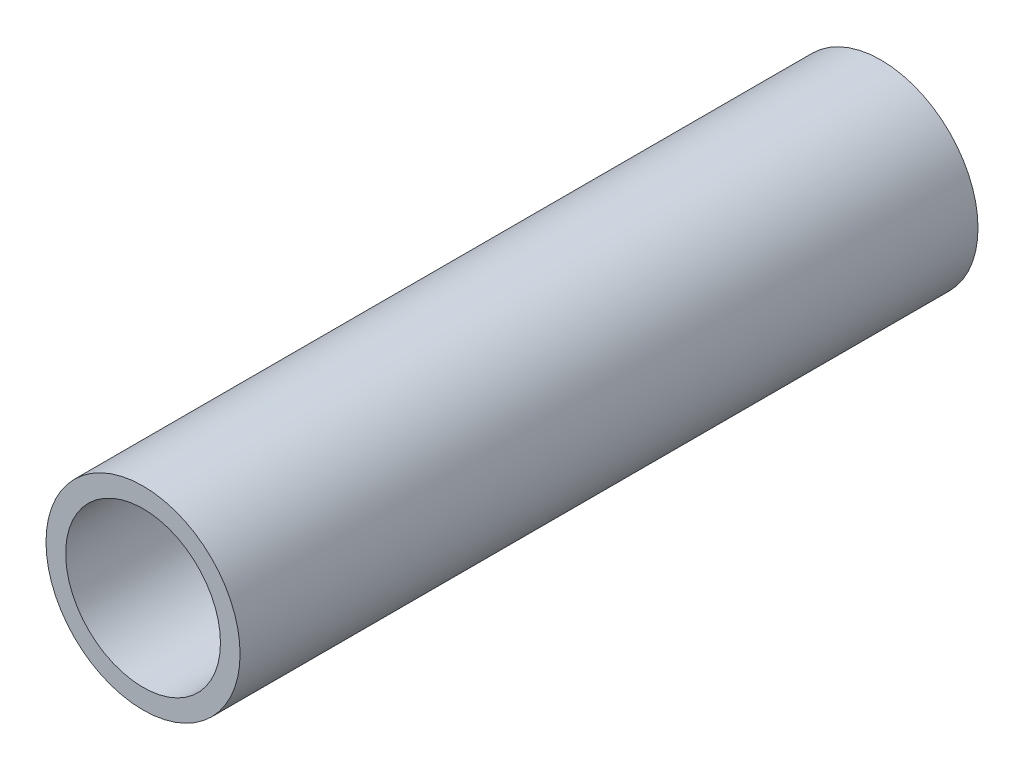
ISO-10303-21;
HEADER;
FILE_DESCRIPTION(('STEP AP214'),'2;1');
FILE_NAME('part.step','',(''),(''),'','','');
FILE_SCHEMA(('AUTOMOTIVE_DESIGN { 1 0 10303 214 1 1 1 1 }'));
ENDSEC;
DATA;
#1=APPLICATION_CONTEXT('core data for automotive mechanical design processes');
#2=APPLICATION_PROTOCOL_DEFINITION('international standard','automotive_design',2000,#1);
#3=PRODUCT_CONTEXT('',#1,'mechanical');
#4=PRODUCT('Part','Part','',(#3));
#5=PRODUCT_RELATED_PRODUCT_CATEGORY('part','',(#4));
#6=PRODUCT_DEFINITION_FORMATION('','',#4);
#7=PRODUCT_DEFINITION_CONTEXT('part definition',#1,'design');
#8=PRODUCT_DEFINITION('design','',#6,#7);
#9=PRODUCT_DEFINITION_SHAPE('','',#8);
#10=(LENGTH_UNIT() NAMED_UNIT(*) SI_UNIT(.MILLI.,.METRE.));
#11=(NAMED_UNIT(*) PLANE_ANGLE_UNIT() SI_UNIT($,.RADIAN.));
#12=(NAMED_UNIT(*) SI_UNIT($,.STERADIAN.) SOLID_ANGLE_UNIT());
#13=UNCERTAINTY_MEASURE_WITH_UNIT(LENGTH_MEASURE(1.E-05),#10,'distance_accuracy_value','');
#14=(GEOMETRIC_REPRESENTATION_CONTEXT(3) GLOBAL_UNCERTAINTY_ASSIGNED_CONTEXT((#13)) GLOBAL_UNIT_ASSIGNED_CONTEXT((#10,
#11,#12)) REPRESENTATION_CONTEXT('',''));
#15=CARTESIAN_POINT('',(0.,0.,0.));
#16=DIRECTION('',(0.,0.,1.));
#17=DIRECTION('',(1.,0.,0.));
#18=AXIS2_PLACEMENT_3D('',#15,#16,#17);
#19=CARTESIAN_POINT('',(0.,0.,63.5));
#20=DIRECTION('',(0.,0.,1.));
#21=DIRECTION('',(1.,0.,0.));
#22=AXIS2_PLACEMENT_3D('',#19,#20,#21);
#23=PLANE('',#22);
#24=CARTESIAN_POINT('',(0.,0.,63.5));
#25=DIRECTION('',(0.,0.,1.));
#26=DIRECTION('',(1.,0.,0.));
#27=AXIS2_PLACEMENT_3D('',#24,#25,#26);
#28=CIRCLE('',#27,16.7005);
#29=CARTESIAN_POINT('',(16.7005,0.,63.5));
#30=VERTEX_POINT('',#29);
#31=EDGE_CURVE('E11',#30,#30,#28,.T.);
#32=ORIENTED_EDGE('',*,*,#31,.T.);
#33=EDGE_LOOP('',(#32));
#34=FACE_BOUND('',#33,.T.);
#35=CARTESIAN_POINT('',(0.,0.,63.5));
#36=DIRECTION('',(0.,0.,1.));
#37=DIRECTION('',(1.,0.,0.));
#38=AXIS2_PLACEMENT_3D('',#35,#36,#37);
#39=CIRCLE('',#38,13.3223);
#40=CARTESIAN_POINT('',(13.3223,0.,63.5));
#41=VERTEX_POINT('',#40);
#42=EDGE_CURVE('E48',#41,#41,#39,.T.);
#43=ORIENTED_EDGE('',*,*,#42,.F.);
#44=EDGE_LOOP('',(#43));
#45=FACE_BOUND('',#44,.T.);
#46=ADVANCED_FACE('F37',(#34,#45),#23,.T.);
#47=CARTESIAN_POINT('',(0.,0.,-63.5));
#48=DIRECTION('',(0.,0.,1.));
#49=DIRECTION('',(1.,0.,0.));
#50=AXIS2_PLACEMENT_3D('',#47,#48,#49);
#51=PLANE('',#50);
#52=CARTESIAN_POINT('',(0.,0.,-63.5));
#53=DIRECTION('',(0.,0.,1.));
#54=DIRECTION('',(1.,0.,0.));
#55=AXIS2_PLACEMENT_3D('',#52,#53,#54);
#56=CIRCLE('',#55,16.7005);
#57=CARTESIAN_POINT('',(16.7005,0.,-63.5));
#58=VERTEX_POINT('',#57);
#59=EDGE_CURVE('E41',#58,#58,#56,.T.);
#60=ORIENTED_EDGE('',*,*,#59,.F.);
#61=EDGE_LOOP('',(#60));
#62=FACE_BOUND('',#61,.T.);
#63=CARTESIAN_POINT('',(0.,0.,-63.5));
#64=DIRECTION('',(0.,0.,1.));
#65=DIRECTION('',(1.,0.,0.));
#66=AXIS2_PLACEMENT_3D('',#63,#64,#65);
#67=CIRCLE('',#66,13.3223);
#68=CARTESIAN_POINT('',(13.3223,0.,-63.5));
#69=VERTEX_POINT('',#68);
#70=EDGE_CURVE('E50',#69,#69,#67,.T.);
#71=ORIENTED_EDGE('',*,*,#70,.T.);
#72=EDGE_LOOP('',(#71));
#73=FACE_BOUND('',#72,.T.);
#74=ADVANCED_FACE('F60',(#62,#73),#51,.F.);
#75=CARTESIAN_POINT('',(0.,0.,63.5));
#76=DIRECTION('',(0.,0.,-1.));
#77=DIRECTION('',(-1.,0.,0.));
#78=AXIS2_PLACEMENT_3D('',#75,#76,#77);
#79=CYLINDRICAL_SURFACE('',#78,16.7005);
#80=ORIENTED_EDGE('',*,*,#31,.F.);
#81=EDGE_LOOP('',(#80));
#82=FACE_BOUND('',#81,.T.);
#83=ORIENTED_EDGE('',*,*,#59,.T.);
#84=EDGE_LOOP('',(#83));
#85=FACE_BOUND('',#84,.T.);
#86=ADVANCED_FACE('F39',(#82,#85),#79,.T.);
#87=CARTESIAN_POINT('',(0.,0.,63.5));
#88=DIRECTION('',(0.,0.,-1.));
#89=DIRECTION('',(-1.,0.,0.));
#90=AXIS2_PLACEMENT_3D('',#87,#88,#89);
#91=CYLINDRICAL_SURFACE('',#90,13.3223);
#92=ORIENTED_EDGE('',*,*,#42,.T.);
#93=EDGE_LOOP('',(#92));
#94=FACE_BOUND('',#93,.T.);
#95=ORIENTED_EDGE('',*,*,#70,.F.);
#96=EDGE_LOOP('',(#95));
#97=FACE_BOUND('',#96,.T.);
#98=ADVANCED_FACE('F56',(#94,#97),#91,.F.);
#99=CLOSED_SHELL('',(#46,#74,#86,#98));
#100=MANIFOLD_SOLID_BREP('B2',#99);
#101=ADVANCED_BREP_SHAPE_REPRESENTATION('',(#18,#100),#14);
#102=SHAPE_DEFINITION_REPRESENTATION(#9,#101);
ENDSEC;
END-ISO-10303-21;
